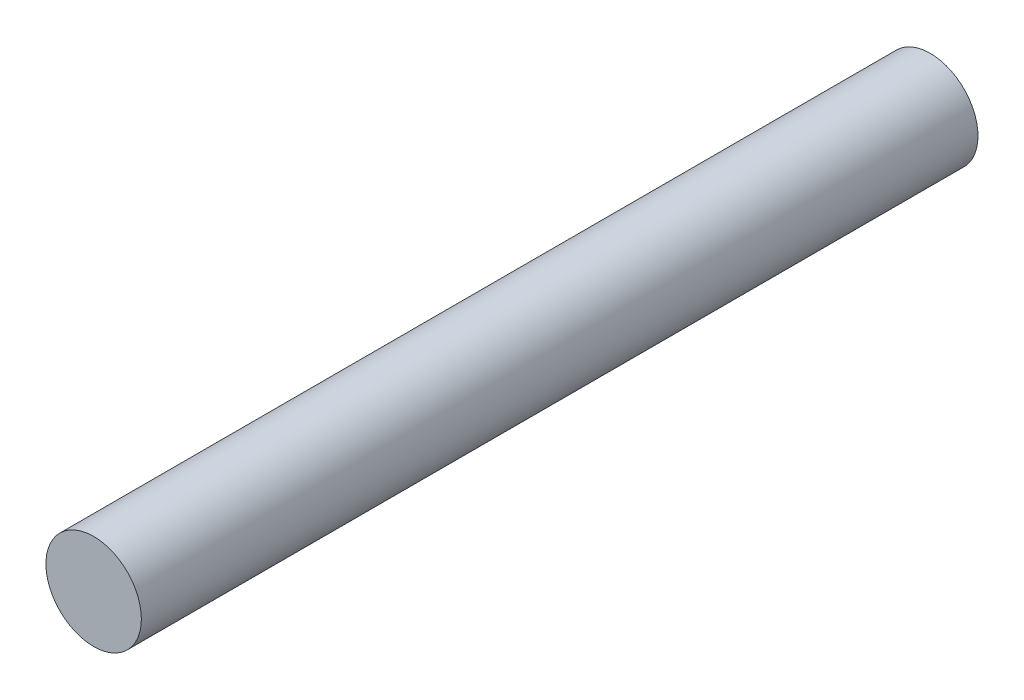
ISO-10303-21;
HEADER;
FILE_DESCRIPTION(('STEP AP214'),'2;1');
FILE_NAME('part.step','',(''),(''),'','','');
FILE_SCHEMA(('AUTOMOTIVE_DESIGN { 1 0 10303 214 1 1 1 1 }'));
ENDSEC;
DATA;
#1=APPLICATION_CONTEXT('core data for automotive mechanical design processes');
#2=APPLICATION_PROTOCOL_DEFINITION('international standard','automotive_design',2000,#1);
#3=PRODUCT_CONTEXT('',#1,'mechanical');
#4=PRODUCT('Part','Part','',(#3));
#5=PRODUCT_RELATED_PRODUCT_CATEGORY('part','',(#4));
#6=PRODUCT_DEFINITION_FORMATION('','',#4);
#7=PRODUCT_DEFINITION_CONTEXT('part definition',#1,'design');
#8=PRODUCT_DEFINITION('design','',#6,#7);
#9=PRODUCT_DEFINITION_SHAPE('','',#8);
#10=(LENGTH_UNIT() NAMED_UNIT(*) SI_UNIT(.MILLI.,.METRE.));
#11=(NAMED_UNIT(*) PLANE_ANGLE_UNIT() SI_UNIT($,.RADIAN.));
#12=(NAMED_UNIT(*) SI_UNIT($,.STERADIAN.) SOLID_ANGLE_UNIT());
#13=UNCERTAINTY_MEASURE_WITH_UNIT(LENGTH_MEASURE(1.E-05),#10,'distance_accuracy_value','');
#14=(GEOMETRIC_REPRESENTATION_CONTEXT(3) GLOBAL_UNCERTAINTY_ASSIGNED_CONTEXT((#13)) GLOBAL_UNIT_ASSIGNED_CONTEXT((#10,
#11,#12)) REPRESENTATION_CONTEXT('',''));
#15=CARTESIAN_POINT('',(0.,0.,0.));
#16=DIRECTION('',(0.,0.,1.));
#17=DIRECTION('',(1.,0.,0.));
#18=AXIS2_PLACEMENT_3D('',#15,#16,#17);
#19=CARTESIAN_POINT('',(0.,0.,149.));
#20=DIRECTION('',(0.,0.,-1.));
#21=DIRECTION('',(-1.,0.,0.));
#22=AXIS2_PLACEMENT_3D('',#19,#20,#21);
#23=CYLINDRICAL_SURFACE('',#22,8.5);
#24=CARTESIAN_POINT('',(0.,0.,149.));
#25=DIRECTION('',(0.,0.,1.));
#26=DIRECTION('',(1.,0.,0.));
#27=AXIS2_PLACEMENT_3D('',#24,#25,#26);
#28=CIRCLE('',#27,8.5);
#29=CARTESIAN_POINT('',(8.5,0.,149.));
#30=VERTEX_POINT('',#29);
#31=EDGE_CURVE('E10',#30,#30,#28,.T.);
#32=ORIENTED_EDGE('',*,*,#31,.F.);
#33=EDGE_LOOP('',(#32));
#34=FACE_BOUND('',#33,.T.);
#35=CARTESIAN_POINT('',(0.,0.,0.));
#36=DIRECTION('',(0.,0.,1.));
#37=DIRECTION('',(1.,0.,0.));
#38=AXIS2_PLACEMENT_3D('',#35,#36,#37);
#39=CIRCLE('',#38,8.5);
#40=CARTESIAN_POINT('',(8.5,0.,0.));
#41=VERTEX_POINT('',#40);
#42=EDGE_CURVE('E40',#41,#41,#39,.T.);
#43=ORIENTED_EDGE('',*,*,#42,.T.);
#44=EDGE_LOOP('',(#43));
#45=FACE_BOUND('',#44,.T.);
#46=ADVANCED_FACE('F37',(#34,#45),#23,.T.);
#47=CARTESIAN_POINT('',(0.,0.,149.));
#48=DIRECTION('',(0.,0.,1.));
#49=DIRECTION('',(1.,0.,0.));
#50=AXIS2_PLACEMENT_3D('',#47,#48,#49);
#51=PLANE('',#50);
#52=ORIENTED_EDGE('',*,*,#31,.T.);
#53=EDGE_LOOP('',(#52));
#54=FACE_BOUND('',#53,.T.);
#55=ADVANCED_FACE('F54',(#54),#51,.T.);
#56=CARTESIAN_POINT('',(0.,0.,0.));
#57=DIRECTION('',(0.,0.,1.));
#58=DIRECTION('',(1.,0.,0.));
#59=AXIS2_PLACEMENT_3D('',#56,#57,#58);
#60=PLANE('',#59);
#61=ORIENTED_EDGE('',*,*,#42,.F.);
#62=EDGE_LOOP('',(#61));
#63=FACE_BOUND('',#62,.T.);
#64=ADVANCED_FACE('F52',(#63),#60,.F.);
#65=CLOSED_SHELL('',(#46,#55,#64));
#66=MANIFOLD_SOLID_BREP('B2',#65);
#67=ADVANCED_BREP_SHAPE_REPRESENTATION('',(#18,#66),#14);
#68=SHAPE_DEFINITION_REPRESENTATION(#9,#67);
ENDSEC;
END-ISO-10303-21;
